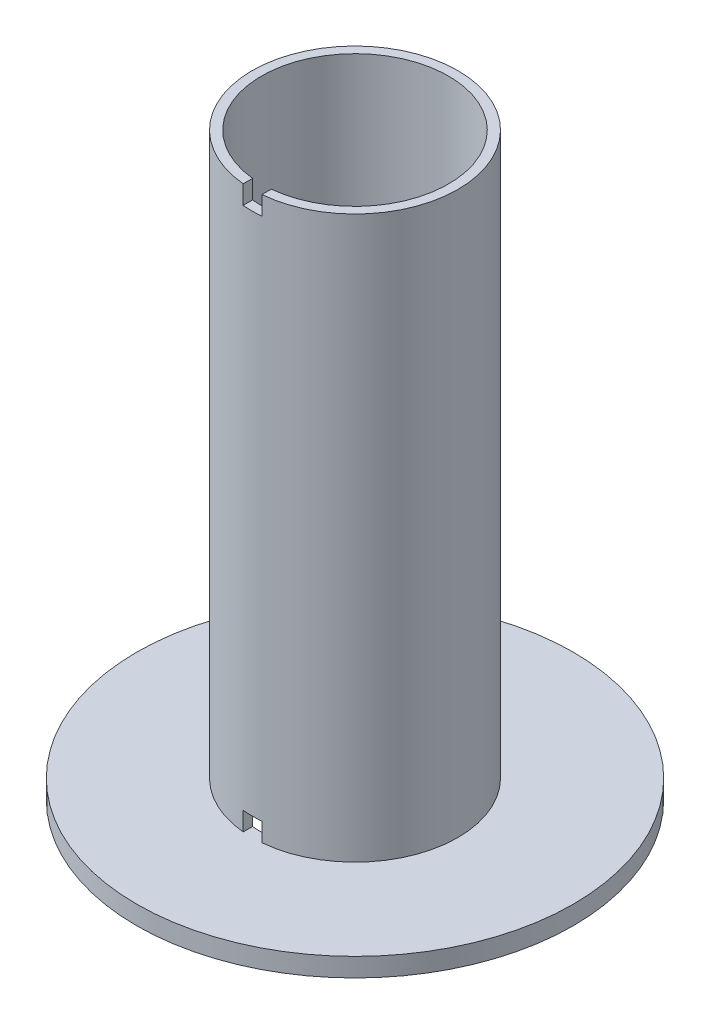
ISO-10303-21;
HEADER;
FILE_DESCRIPTION(('STEP AP214'),'2;1');
FILE_NAME('part.step','',(''),(''),'','','');
FILE_SCHEMA(('AUTOMOTIVE_DESIGN { 1 0 10303 214 1 1 1 1 }'));
ENDSEC;
DATA;
#1=APPLICATION_CONTEXT('core data for automotive mechanical design processes');
#2=APPLICATION_PROTOCOL_DEFINITION('international standard','automotive_design',2000,#1);
#3=PRODUCT_CONTEXT('',#1,'mechanical');
#4=PRODUCT('Part','Part','',(#3));
#5=PRODUCT_RELATED_PRODUCT_CATEGORY('part','',(#4));
#6=PRODUCT_DEFINITION_FORMATION('','',#4);
#7=PRODUCT_DEFINITION_CONTEXT('part definition',#1,'design');
#8=PRODUCT_DEFINITION('design','',#6,#7);
#9=PRODUCT_DEFINITION_SHAPE('','',#8);
#10=(LENGTH_UNIT() NAMED_UNIT(*) SI_UNIT(.MILLI.,.METRE.));
#11=(NAMED_UNIT(*) PLANE_ANGLE_UNIT() SI_UNIT($,.RADIAN.));
#12=(NAMED_UNIT(*) SI_UNIT($,.STERADIAN.) SOLID_ANGLE_UNIT());
#13=UNCERTAINTY_MEASURE_WITH_UNIT(LENGTH_MEASURE(1.E-05),#10,'distance_accuracy_value','');
#14=(GEOMETRIC_REPRESENTATION_CONTEXT(3) GLOBAL_UNCERTAINTY_ASSIGNED_CONTEXT((#13)) GLOBAL_UNIT_ASSIGNED_CONTEXT((#10,
#11,#12)) REPRESENTATION_CONTEXT('',''));
#15=CARTESIAN_POINT('',(0.,0.,0.));
#16=DIRECTION('',(0.,0.,1.));
#17=DIRECTION('',(1.,0.,0.));
#18=AXIS2_PLACEMENT_3D('',#15,#16,#17);
#19=CARTESIAN_POINT('',(0.,7.62,0.));
#20=DIRECTION('',(0.,-1.,0.));
#21=DIRECTION('',(0.,0.,-1.));
#22=AXIS2_PLACEMENT_3D('',#19,#20,#21);
#23=CYLINDRICAL_SURFACE('',#22,38.1);
#24=CARTESIAN_POINT('',(0.,0.,0.));
#25=DIRECTION('',(0.,1.,0.));
#26=DIRECTION('',(0.,0.,1.));
#27=AXIS2_PLACEMENT_3D('',#24,#25,#26);
#28=CIRCLE('',#27,38.1);
#29=CARTESIAN_POINT('',(0.,0.,38.1));
#30=VERTEX_POINT('',#29);
#31=EDGE_CURVE('E132',#30,#30,#28,.T.);
#32=ORIENTED_EDGE('',*,*,#31,.F.);
#33=EDGE_LOOP('',(#32));
#34=FACE_BOUND('',#33,.T.);
#35=CARTESIAN_POINT('',(0.,236.22,0.));
#36=DIRECTION('',(0.,1.,0.));
#37=DIRECTION('',(0.,0.,1.));
#38=AXIS2_PLACEMENT_3D('',#35,#36,#37);
#39=CIRCLE('',#38,38.1);
#40=CARTESIAN_POINT('',(3.81,236.22,37.9090213537622));
#41=VERTEX_POINT('',#40);
#42=CARTESIAN_POINT('',(-3.81,236.22,37.9090213537622));
#43=VERTEX_POINT('',#42);
#44=EDGE_CURVE('E141',#41,#43,#39,.T.);
#45=ORIENTED_EDGE('',*,*,#44,.T.);
#46=DIRECTION('',(0.,-1.,0.));
#47=VECTOR('',#46,1.);
#48=CARTESIAN_POINT('',(-3.81000000000001,7.62,37.9090213537622));
#49=LINE('',#48,#47);
#50=CARTESIAN_POINT('',(-3.81,228.6,37.9090213537622));
#51=VERTEX_POINT('',#50);
#52=EDGE_CURVE('E109',#43,#51,#49,.T.);
#53=ORIENTED_EDGE('',*,*,#52,.T.);
#54=CARTESIAN_POINT('',(0.,228.6,0.));
#55=DIRECTION('',(0.,1.,0.));
#56=DIRECTION('',(0.,0.,1.));
#57=AXIS2_PLACEMENT_3D('',#54,#55,#56);
#58=CIRCLE('',#57,38.1);
#59=CARTESIAN_POINT('',(3.81,228.6,37.9090213537622));
#60=VERTEX_POINT('',#59);
#61=EDGE_CURVE('E200',#51,#60,#58,.T.);
#62=ORIENTED_EDGE('',*,*,#61,.T.);
#63=DIRECTION('',(0.,-1.,0.));
#64=VECTOR('',#63,1.);
#65=CARTESIAN_POINT('',(3.80999999999996,7.62,37.9090213537622));
#66=LINE('',#65,#64);
#67=EDGE_CURVE('E190',#60,#41,#66,.F.);
#68=ORIENTED_EDGE('',*,*,#67,.T.);
#69=EDGE_LOOP('',(#45,#53,#62,#68));
#70=FACE_BOUND('',#69,.T.);
#71=CARTESIAN_POINT('',(0.,15.24,0.));
#72=DIRECTION('',(0.,-1.,0.));
#73=DIRECTION('',(1.,0.,0.));
#74=AXIS2_PLACEMENT_3D('',#71,#72,#73);
#75=CIRCLE('',#74,38.1);
#76=CARTESIAN_POINT('',(3.81,15.24,37.9090213537622));
#77=VERTEX_POINT('',#76);
#78=CARTESIAN_POINT('',(-3.81,15.24,37.9090213537622));
#79=VERTEX_POINT('',#78);
#80=EDGE_CURVE('E206',#77,#79,#75,.T.);
#81=ORIENTED_EDGE('',*,*,#80,.T.);
#82=DIRECTION('',(0.,-1.,0.));
#83=VECTOR('',#82,1.);
#84=CARTESIAN_POINT('',(-3.81,7.62,37.9090213537622));
#85=LINE('',#84,#83);
#86=CARTESIAN_POINT('',(-3.81,7.62,37.9090213537622));
#87=VERTEX_POINT('',#86);
#88=EDGE_CURVE('E175',#79,#87,#85,.T.);
#89=ORIENTED_EDGE('',*,*,#88,.T.);
#90=CARTESIAN_POINT('',(0.,7.62,0.));
#91=DIRECTION('',(0.,1.,0.));
#92=DIRECTION('',(0.,0.,1.));
#93=AXIS2_PLACEMENT_3D('',#90,#91,#92);
#94=CIRCLE('',#93,38.1);
#95=CARTESIAN_POINT('',(3.81,7.62,37.9090213537622));
#96=VERTEX_POINT('',#95);
#97=EDGE_CURVE('E212',#87,#96,#94,.T.);
#98=ORIENTED_EDGE('',*,*,#97,.T.);
#99=DIRECTION('',(0.,-1.,0.));
#100=VECTOR('',#99,1.);
#101=CARTESIAN_POINT('',(3.81,7.62,37.9090213537622));
#102=LINE('',#101,#100);
#103=EDGE_CURVE('E209',#96,#77,#102,.F.);
#104=ORIENTED_EDGE('',*,*,#103,.T.);
#105=EDGE_LOOP('',(#81,#89,#98,#104));
#106=FACE_BOUND('',#105,.T.);
#107=ADVANCED_FACE('F39',(#34,#70,#106),#23,.F.);
#108=CARTESIAN_POINT('',(0.,236.22,0.));
#109=DIRECTION('',(0.,1.,0.));
#110=DIRECTION('',(0.,0.,1.));
#111=AXIS2_PLACEMENT_3D('',#108,#109,#110);
#112=PLANE('',#111);
#113=CARTESIAN_POINT('',(0.,236.22,0.));
#114=DIRECTION('',(0.,1.,0.));
#115=DIRECTION('',(0.,0.,1.));
#116=AXIS2_PLACEMENT_3D('',#113,#114,#115);
#117=CIRCLE('',#116,41.91);
#118=CARTESIAN_POINT('',(3.81,236.22,41.7364588818937));
#119=VERTEX_POINT('',#118);
#120=CARTESIAN_POINT('',(-3.81,236.22,41.7364588818937));
#121=VERTEX_POINT('',#120);
#122=EDGE_CURVE('E123',#119,#121,#117,.T.);
#123=ORIENTED_EDGE('',*,*,#122,.T.);
#124=DIRECTION('',(0.,0.,-1.));
#125=VECTOR('',#124,1.);
#126=CARTESIAN_POINT('',(-3.81,236.22,88.9));
#127=LINE('',#126,#125);
#128=EDGE_CURVE('E102',#121,#43,#127,.T.);
#129=ORIENTED_EDGE('',*,*,#128,.T.);
#130=ORIENTED_EDGE('',*,*,#44,.F.);
#131=DIRECTION('',(0.,0.,-1.));
#132=VECTOR('',#131,1.);
#133=CARTESIAN_POINT('',(3.81,236.22,88.9));
#134=LINE('',#133,#132);
#135=EDGE_CURVE('E115',#119,#41,#134,.T.);
#136=ORIENTED_EDGE('',*,*,#135,.F.);
#137=EDGE_LOOP('',(#123,#129,#130,#136));
#138=FACE_BOUND('',#137,.T.);
#139=ADVANCED_FACE('F130',(#138),#112,.T.);
#140=CARTESIAN_POINT('',(0.,236.22,0.));
#141=DIRECTION('',(0.,-1.,0.));
#142=DIRECTION('',(0.,0.,-1.));
#143=AXIS2_PLACEMENT_3D('',#140,#141,#142);
#144=CYLINDRICAL_SURFACE('',#143,41.91);
#145=DIRECTION('',(0.,-1.,0.));
#146=VECTOR('',#145,1.);
#147=CARTESIAN_POINT('',(-3.81,236.22,41.7364588818937));
#148=LINE('',#147,#146);
#149=CARTESIAN_POINT('',(-3.81,228.6,41.7364588818937));
#150=VERTEX_POINT('',#149);
#151=EDGE_CURVE('E106',#121,#150,#148,.T.);
#152=ORIENTED_EDGE('',*,*,#151,.F.);
#153=ORIENTED_EDGE('',*,*,#122,.F.);
#154=DIRECTION('',(0.,-1.,0.));
#155=VECTOR('',#154,1.);
#156=CARTESIAN_POINT('',(3.81,236.22,41.7364588818937));
#157=LINE('',#156,#155);
#158=CARTESIAN_POINT('',(3.81,228.6,41.7364588818937));
#159=VERTEX_POINT('',#158);
#160=EDGE_CURVE('E150',#159,#119,#157,.F.);
#161=ORIENTED_EDGE('',*,*,#160,.F.);
#162=CARTESIAN_POINT('',(0.,228.6,0.));
#163=DIRECTION('',(0.,1.,0.));
#164=DIRECTION('',(0.,0.,1.));
#165=AXIS2_PLACEMENT_3D('',#162,#163,#164);
#166=CIRCLE('',#165,41.91);
#167=EDGE_CURVE('E125',#150,#159,#166,.T.);
#168=ORIENTED_EDGE('',*,*,#167,.F.);
#169=EDGE_LOOP('',(#152,#153,#161,#168));
#170=FACE_BOUND('',#169,.T.);
#171=DIRECTION('',(0.,-1.,0.));
#172=VECTOR('',#171,1.);
#173=CARTESIAN_POINT('',(-3.81000000000001,236.22,41.7364588818937));
#174=LINE('',#173,#172);
#175=CARTESIAN_POINT('',(-3.81,15.24,41.7364588818937));
#176=VERTEX_POINT('',#175);
#177=CARTESIAN_POINT('',(-3.81,7.61999999999999,41.7364588818937));
#178=VERTEX_POINT('',#177);
#179=EDGE_CURVE('E11',#176,#178,#174,.T.);
#180=ORIENTED_EDGE('',*,*,#179,.F.);
#181=CARTESIAN_POINT('',(0.,15.24,0.));
#182=DIRECTION('',(0.,-1.,0.));
#183=DIRECTION('',(1.,0.,0.));
#184=AXIS2_PLACEMENT_3D('',#181,#182,#183);
#185=CIRCLE('',#184,41.91);
#186=CARTESIAN_POINT('',(3.81,15.24,41.7364588818937));
#187=VERTEX_POINT('',#186);
#188=EDGE_CURVE('E127',#187,#176,#185,.T.);
#189=ORIENTED_EDGE('',*,*,#188,.F.);
#190=DIRECTION('',(0.,-1.,0.));
#191=VECTOR('',#190,1.);
#192=CARTESIAN_POINT('',(3.80999999999996,236.22,41.7364588818937));
#193=LINE('',#192,#191);
#194=CARTESIAN_POINT('',(3.81,7.62,41.7364588818937));
#195=VERTEX_POINT('',#194);
#196=EDGE_CURVE('E48',#195,#187,#193,.F.);
#197=ORIENTED_EDGE('',*,*,#196,.F.);
#198=CARTESIAN_POINT('',(0.,7.62,0.));
#199=DIRECTION('',(0.,1.,0.));
#200=DIRECTION('',(0.,0.,1.));
#201=AXIS2_PLACEMENT_3D('',#198,#199,#200);
#202=CIRCLE('',#201,41.91);
#203=EDGE_CURVE('E133',#195,#178,#202,.T.);
#204=ORIENTED_EDGE('',*,*,#203,.T.);
#205=EDGE_LOOP('',(#180,#189,#197,#204));
#206=FACE_BOUND('',#205,.T.);
#207=ADVANCED_FACE('F120',(#170,#206),#144,.T.);
#208=CARTESIAN_POINT('',(0.,7.62,0.));
#209=DIRECTION('',(0.,1.,0.));
#210=DIRECTION('',(0.,0.,1.));
#211=AXIS2_PLACEMENT_3D('',#208,#209,#210);
#212=PLANE('',#211);
#213=DIRECTION('',(0.,0.,-1.));
#214=VECTOR('',#213,1.);
#215=CARTESIAN_POINT('',(-3.81,7.62,88.9));
#216=LINE('',#215,#214);
#217=EDGE_CURVE('E188',#178,#87,#216,.T.);
#218=ORIENTED_EDGE('',*,*,#217,.F.);
#219=ORIENTED_EDGE('',*,*,#203,.F.);
#220=DIRECTION('',(0.,0.,-1.));
#221=VECTOR('',#220,1.);
#222=CARTESIAN_POINT('',(3.81,7.62,88.9));
#223=LINE('',#222,#221);
#224=EDGE_CURVE('E166',#195,#96,#223,.T.);
#225=ORIENTED_EDGE('',*,*,#224,.T.);
#226=ORIENTED_EDGE('',*,*,#97,.F.);
#227=EDGE_LOOP('',(#218,#219,#225,#226));
#228=FACE_BOUND('',#227,.T.);
#229=CARTESIAN_POINT('',(0.,7.62,0.));
#230=DIRECTION('',(0.,1.,0.));
#231=DIRECTION('',(0.,0.,1.));
#232=AXIS2_PLACEMENT_3D('',#229,#230,#231);
#233=CIRCLE('',#232,88.9);
#234=CARTESIAN_POINT('',(0.,7.62,88.9));
#235=VERTEX_POINT('',#234);
#236=EDGE_CURVE('E146',#235,#235,#233,.T.);
#237=ORIENTED_EDGE('',*,*,#236,.T.);
#238=EDGE_LOOP('',(#237));
#239=FACE_BOUND('',#238,.T.);
#240=ADVANCED_FACE('F241',(#228,#239),#212,.T.);
#241=CARTESIAN_POINT('',(0.,0.,0.));
#242=DIRECTION('',(0.,1.,0.));
#243=DIRECTION('',(0.,0.,1.));
#244=AXIS2_PLACEMENT_3D('',#241,#242,#243);
#245=PLANE('',#244);
#246=CARTESIAN_POINT('',(0.,0.,0.));
#247=DIRECTION('',(0.,1.,0.));
#248=DIRECTION('',(0.,0.,1.));
#249=AXIS2_PLACEMENT_3D('',#246,#247,#248);
#250=CIRCLE('',#249,88.9);
#251=CARTESIAN_POINT('',(0.,0.,88.9));
#252=VERTEX_POINT('',#251);
#253=EDGE_CURVE('E138',#252,#252,#250,.T.);
#254=ORIENTED_EDGE('',*,*,#253,.F.);
#255=EDGE_LOOP('',(#254));
#256=FACE_BOUND('',#255,.T.);
#257=ORIENTED_EDGE('',*,*,#31,.T.);
#258=EDGE_LOOP('',(#257));
#259=FACE_BOUND('',#258,.T.);
#260=ADVANCED_FACE('F243',(#256,#259),#245,.F.);
#261=CARTESIAN_POINT('',(0.,7.62,0.));
#262=DIRECTION('',(0.,-1.,0.));
#263=DIRECTION('',(0.,0.,-1.));
#264=AXIS2_PLACEMENT_3D('',#261,#262,#263);
#265=CYLINDRICAL_SURFACE('',#264,88.9);
#266=ORIENTED_EDGE('',*,*,#236,.F.);
#267=EDGE_LOOP('',(#266));
#268=FACE_BOUND('',#267,.T.);
#269=ORIENTED_EDGE('',*,*,#253,.T.);
#270=EDGE_LOOP('',(#269));
#271=FACE_BOUND('',#270,.T.);
#272=ADVANCED_FACE('F41',(#268,#271),#265,.T.);
#273=CARTESIAN_POINT('',(-3.81,228.6,88.9));
#274=DIRECTION('',(1.,0.,0.));
#275=DIRECTION('',(0.,1.,0.));
#276=AXIS2_PLACEMENT_3D('',#273,#274,#275);
#277=PLANE('',#276);
#278=ORIENTED_EDGE('',*,*,#128,.F.);
#279=ORIENTED_EDGE('',*,*,#151,.T.);
#280=DIRECTION('',(0.,0.,-1.));
#281=VECTOR('',#280,1.);
#282=CARTESIAN_POINT('',(-3.81,228.6,88.9));
#283=LINE('',#282,#281);
#284=EDGE_CURVE('E178',#150,#51,#283,.T.);
#285=ORIENTED_EDGE('',*,*,#284,.T.);
#286=ORIENTED_EDGE('',*,*,#52,.F.);
#287=EDGE_LOOP('',(#278,#279,#285,#286));
#288=FACE_BOUND('',#287,.T.);
#289=ADVANCED_FACE('F104',(#288),#277,.T.);
#290=CARTESIAN_POINT('',(-3.81,228.6,88.9));
#291=DIRECTION('',(0.,1.,0.));
#292=DIRECTION('',(0.,0.,1.));
#293=AXIS2_PLACEMENT_3D('',#290,#291,#292);
#294=PLANE('',#293);
#295=ORIENTED_EDGE('',*,*,#284,.F.);
#296=ORIENTED_EDGE('',*,*,#167,.T.);
#297=DIRECTION('',(0.,0.,-1.));
#298=VECTOR('',#297,1.);
#299=CARTESIAN_POINT('',(3.81,228.6,88.9));
#300=LINE('',#299,#298);
#301=EDGE_CURVE('E183',#159,#60,#300,.T.);
#302=ORIENTED_EDGE('',*,*,#301,.T.);
#303=ORIENTED_EDGE('',*,*,#61,.F.);
#304=EDGE_LOOP('',(#295,#296,#302,#303));
#305=FACE_BOUND('',#304,.T.);
#306=ADVANCED_FACE('F222',(#305),#294,.T.);
#307=CARTESIAN_POINT('',(3.81,228.6,88.9));
#308=DIRECTION('',(-1.,0.,0.));
#309=DIRECTION('',(0.,-1.,0.));
#310=AXIS2_PLACEMENT_3D('',#307,#308,#309);
#311=PLANE('',#310);
#312=ORIENTED_EDGE('',*,*,#301,.F.);
#313=ORIENTED_EDGE('',*,*,#160,.T.);
#314=ORIENTED_EDGE('',*,*,#135,.T.);
#315=ORIENTED_EDGE('',*,*,#67,.F.);
#316=EDGE_LOOP('',(#312,#313,#314,#315));
#317=FACE_BOUND('',#316,.T.);
#318=ADVANCED_FACE('F220',(#317),#311,.T.);
#319=CARTESIAN_POINT('',(-3.81,15.24,88.9));
#320=DIRECTION('',(1.,0.,0.));
#321=DIRECTION('',(0.,1.,0.));
#322=AXIS2_PLACEMENT_3D('',#319,#320,#321);
#323=PLANE('',#322);
#324=DIRECTION('',(0.,0.,-1.));
#325=VECTOR('',#324,1.);
#326=CARTESIAN_POINT('',(-3.81,15.24,88.9));
#327=LINE('',#326,#325);
#328=EDGE_CURVE('E55',#176,#79,#327,.T.);
#329=ORIENTED_EDGE('',*,*,#328,.F.);
#330=ORIENTED_EDGE('',*,*,#179,.T.);
#331=ORIENTED_EDGE('',*,*,#217,.T.);
#332=ORIENTED_EDGE('',*,*,#88,.F.);
#333=EDGE_LOOP('',(#329,#330,#331,#332));
#334=FACE_BOUND('',#333,.T.);
#335=ADVANCED_FACE('F171',(#334),#323,.T.);
#336=CARTESIAN_POINT('',(3.81,15.24,88.9));
#337=DIRECTION('',(-1.,0.,0.));
#338=DIRECTION('',(0.,-1.,0.));
#339=AXIS2_PLACEMENT_3D('',#336,#337,#338);
#340=PLANE('',#339);
#341=ORIENTED_EDGE('',*,*,#224,.F.);
#342=ORIENTED_EDGE('',*,*,#196,.T.);
#343=DIRECTION('',(0.,0.,-1.));
#344=VECTOR('',#343,1.);
#345=CARTESIAN_POINT('',(3.81,15.24,88.9));
#346=LINE('',#345,#344);
#347=EDGE_CURVE('E60',#187,#77,#346,.T.);
#348=ORIENTED_EDGE('',*,*,#347,.T.);
#349=ORIENTED_EDGE('',*,*,#103,.F.);
#350=EDGE_LOOP('',(#341,#342,#348,#349));
#351=FACE_BOUND('',#350,.T.);
#352=ADVANCED_FACE('F163',(#351),#340,.T.);
#353=CARTESIAN_POINT('',(-3.81,15.24,88.9));
#354=DIRECTION('',(0.,-1.,0.));
#355=DIRECTION('',(1.,0.,0.));
#356=AXIS2_PLACEMENT_3D('',#353,#354,#355);
#357=PLANE('',#356);
#358=ORIENTED_EDGE('',*,*,#347,.F.);
#359=ORIENTED_EDGE('',*,*,#188,.T.);
#360=ORIENTED_EDGE('',*,*,#328,.T.);
#361=ORIENTED_EDGE('',*,*,#80,.F.);
#362=EDGE_LOOP('',(#358,#359,#360,#361));
#363=FACE_BOUND('',#362,.T.);
#364=ADVANCED_FACE('F169',(#363),#357,.T.);
#365=CLOSED_SHELL('',(#107,#139,#207,#240,#260,#272,#289,#306,#318,#335,#352,#364));
#366=MANIFOLD_SOLID_BREP('B2',#365);
#367=ADVANCED_BREP_SHAPE_REPRESENTATION('',(#18,#366),#14);
#368=SHAPE_DEFINITION_REPRESENTATION(#9,#367);
ENDSEC;
END-ISO-10303-21;
